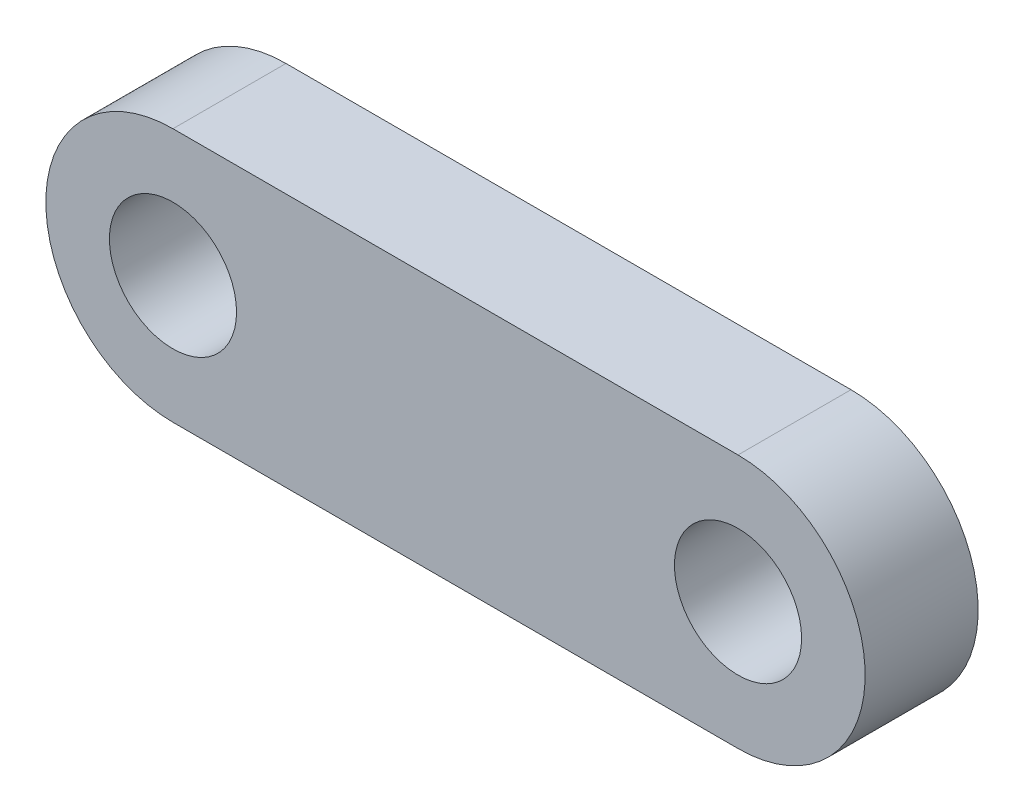
ISO-10303-21;
HEADER;
FILE_DESCRIPTION(('STEP AP214'),'2;1');
FILE_NAME('part.step','',(''),(''),'','','');
FILE_SCHEMA(('AUTOMOTIVE_DESIGN { 1 0 10303 214 1 1 1 1 }'));
ENDSEC;
DATA;
#1=APPLICATION_CONTEXT('core data for automotive mechanical design processes');
#2=APPLICATION_PROTOCOL_DEFINITION('international standard','automotive_design',2000,#1);
#3=PRODUCT_CONTEXT('',#1,'mechanical');
#4=PRODUCT('Part','Part','',(#3));
#5=PRODUCT_RELATED_PRODUCT_CATEGORY('part','',(#4));
#6=PRODUCT_DEFINITION_FORMATION('','',#4);
#7=PRODUCT_DEFINITION_CONTEXT('part definition',#1,'design');
#8=PRODUCT_DEFINITION('design','',#6,#7);
#9=PRODUCT_DEFINITION_SHAPE('','',#8);
#10=(LENGTH_UNIT() NAMED_UNIT(*) SI_UNIT(.MILLI.,.METRE.));
#11=(NAMED_UNIT(*) PLANE_ANGLE_UNIT() SI_UNIT($,.RADIAN.));
#12=(NAMED_UNIT(*) SI_UNIT($,.STERADIAN.) SOLID_ANGLE_UNIT());
#13=UNCERTAINTY_MEASURE_WITH_UNIT(LENGTH_MEASURE(1.E-05),#10,'distance_accuracy_value','');
#14=(GEOMETRIC_REPRESENTATION_CONTEXT(3) GLOBAL_UNCERTAINTY_ASSIGNED_CONTEXT((#13)) GLOBAL_UNIT_ASSIGNED_CONTEXT((#10,
#11,#12)) REPRESENTATION_CONTEXT('',''));
#15=CARTESIAN_POINT('',(0.,0.,0.));
#16=DIRECTION('',(0.,0.,1.));
#17=DIRECTION('',(1.,0.,0.));
#18=AXIS2_PLACEMENT_3D('',#15,#16,#17);
#19=CARTESIAN_POINT('',(-10.,0.,4.));
#20=DIRECTION('',(0.,0.,-1.));
#21=DIRECTION('',(-1.,0.,0.));
#22=AXIS2_PLACEMENT_3D('',#19,#20,#21);
#23=CYLINDRICAL_SURFACE('',#22,4.5);
#24=CARTESIAN_POINT('',(-10.,0.,0.));
#25=DIRECTION('',(0.,0.,1.));
#26=DIRECTION('',(1.,0.,0.));
#27=AXIS2_PLACEMENT_3D('',#24,#25,#26);
#28=CIRCLE('',#27,4.5);
#29=CARTESIAN_POINT('',(-10.,4.5,0.));
#30=VERTEX_POINT('',#29);
#31=CARTESIAN_POINT('',(-10.,-4.5,0.));
#32=VERTEX_POINT('',#31);
#33=EDGE_CURVE('E118',#30,#32,#28,.T.);
#34=ORIENTED_EDGE('',*,*,#33,.T.);
#35=DIRECTION('',(0.,0.,-1.));
#36=VECTOR('',#35,1.);
#37=CARTESIAN_POINT('',(-10.,-4.5,4.));
#38=LINE('',#37,#36);
#39=CARTESIAN_POINT('',(-10.,-4.5,4.));
#40=VERTEX_POINT('',#39);
#41=EDGE_CURVE('E11',#40,#32,#38,.T.);
#42=ORIENTED_EDGE('',*,*,#41,.F.);
#43=CARTESIAN_POINT('',(-10.,0.,4.));
#44=DIRECTION('',(0.,0.,1.));
#45=DIRECTION('',(1.,0.,0.));
#46=AXIS2_PLACEMENT_3D('',#43,#44,#45);
#47=CIRCLE('',#46,4.5);
#48=CARTESIAN_POINT('',(-10.,4.5,4.));
#49=VERTEX_POINT('',#48);
#50=EDGE_CURVE('E87',#49,#40,#47,.T.);
#51=ORIENTED_EDGE('',*,*,#50,.F.);
#52=DIRECTION('',(0.,0.,-1.));
#53=VECTOR('',#52,1.);
#54=CARTESIAN_POINT('',(-10.,4.5,4.));
#55=LINE('',#54,#53);
#56=EDGE_CURVE('E62',#49,#30,#55,.T.);
#57=ORIENTED_EDGE('',*,*,#56,.T.);
#58=EDGE_LOOP('',(#34,#42,#51,#57));
#59=FACE_BOUND('',#58,.T.);
#60=ADVANCED_FACE('F45',(#59),#23,.T.);
#61=CARTESIAN_POINT('',(0.,-4.5,4.));
#62=DIRECTION('',(0.,-1.,0.));
#63=DIRECTION('',(1.,0.,0.));
#64=AXIS2_PLACEMENT_3D('',#61,#62,#63);
#65=PLANE('',#64);
#66=DIRECTION('',(-1.,0.,0.));
#67=VECTOR('',#66,1.);
#68=CARTESIAN_POINT('',(0.,-4.5,0.));
#69=LINE('',#68,#67);
#70=CARTESIAN_POINT('',(10.,-4.5,0.));
#71=VERTEX_POINT('',#70);
#72=EDGE_CURVE('E97',#71,#32,#69,.T.);
#73=ORIENTED_EDGE('',*,*,#72,.F.);
#74=DIRECTION('',(0.,0.,-1.));
#75=VECTOR('',#74,1.);
#76=CARTESIAN_POINT('',(10.,-4.5,4.));
#77=LINE('',#76,#75);
#78=CARTESIAN_POINT('',(10.,-4.5,4.));
#79=VERTEX_POINT('',#78);
#80=EDGE_CURVE('E54',#79,#71,#77,.T.);
#81=ORIENTED_EDGE('',*,*,#80,.F.);
#82=DIRECTION('',(-1.,0.,0.));
#83=VECTOR('',#82,1.);
#84=CARTESIAN_POINT('',(0.,-4.5,4.));
#85=LINE('',#84,#83);
#86=EDGE_CURVE('E95',#79,#40,#85,.T.);
#87=ORIENTED_EDGE('',*,*,#86,.T.);
#88=ORIENTED_EDGE('',*,*,#41,.T.);
#89=EDGE_LOOP('',(#73,#81,#87,#88));
#90=FACE_BOUND('',#89,.T.);
#91=ADVANCED_FACE('F94',(#90),#65,.T.);
#92=CARTESIAN_POINT('',(10.,0.,4.));
#93=DIRECTION('',(0.,0.,-1.));
#94=DIRECTION('',(-1.,0.,0.));
#95=AXIS2_PLACEMENT_3D('',#92,#93,#94);
#96=CYLINDRICAL_SURFACE('',#95,4.5);
#97=CARTESIAN_POINT('',(10.,0.,0.));
#98=DIRECTION('',(0.,0.,1.));
#99=DIRECTION('',(1.,0.,0.));
#100=AXIS2_PLACEMENT_3D('',#97,#98,#99);
#101=CIRCLE('',#100,4.5);
#102=CARTESIAN_POINT('',(10.,4.5,0.));
#103=VERTEX_POINT('',#102);
#104=EDGE_CURVE('E121',#71,#103,#101,.T.);
#105=ORIENTED_EDGE('',*,*,#104,.T.);
#106=DIRECTION('',(0.,0.,-1.));
#107=VECTOR('',#106,1.);
#108=CARTESIAN_POINT('',(10.,4.5,4.));
#109=LINE('',#108,#107);
#110=CARTESIAN_POINT('',(10.,4.5,4.));
#111=VERTEX_POINT('',#110);
#112=EDGE_CURVE('E76',#111,#103,#109,.T.);
#113=ORIENTED_EDGE('',*,*,#112,.F.);
#114=CARTESIAN_POINT('',(10.,0.,4.));
#115=DIRECTION('',(0.,0.,1.));
#116=DIRECTION('',(1.,0.,0.));
#117=AXIS2_PLACEMENT_3D('',#114,#115,#116);
#118=CIRCLE('',#117,4.5);
#119=EDGE_CURVE('E100',#79,#111,#118,.T.);
#120=ORIENTED_EDGE('',*,*,#119,.F.);
#121=ORIENTED_EDGE('',*,*,#80,.T.);
#122=EDGE_LOOP('',(#105,#113,#120,#121));
#123=FACE_BOUND('',#122,.T.);
#124=ADVANCED_FACE('F101',(#123),#96,.T.);
#125=CARTESIAN_POINT('',(0.,4.5,4.));
#126=DIRECTION('',(0.,1.,0.));
#127=DIRECTION('',(-1.,0.,0.));
#128=AXIS2_PLACEMENT_3D('',#125,#126,#127);
#129=PLANE('',#128);
#130=DIRECTION('',(1.,0.,0.));
#131=VECTOR('',#130,1.);
#132=CARTESIAN_POINT('',(0.,4.5,0.));
#133=LINE('',#132,#131);
#134=EDGE_CURVE('E123',#30,#103,#133,.T.);
#135=ORIENTED_EDGE('',*,*,#134,.F.);
#136=ORIENTED_EDGE('',*,*,#56,.F.);
#137=DIRECTION('',(1.,0.,0.));
#138=VECTOR('',#137,1.);
#139=CARTESIAN_POINT('',(0.,4.5,4.));
#140=LINE('',#139,#138);
#141=EDGE_CURVE('E102',#49,#111,#140,.T.);
#142=ORIENTED_EDGE('',*,*,#141,.T.);
#143=ORIENTED_EDGE('',*,*,#112,.T.);
#144=EDGE_LOOP('',(#135,#136,#142,#143));
#145=FACE_BOUND('',#144,.T.);
#146=ADVANCED_FACE('F157',(#145),#129,.T.);
#147=CARTESIAN_POINT('',(-10.,0.,4.));
#148=DIRECTION('',(0.,0.,-1.));
#149=DIRECTION('',(-1.,0.,0.));
#150=AXIS2_PLACEMENT_3D('',#147,#148,#149);
#151=CYLINDRICAL_SURFACE('',#150,2.25);
#152=CARTESIAN_POINT('',(-10.,0.,4.));
#153=DIRECTION('',(0.,0.,1.));
#154=DIRECTION('',(1.,0.,0.));
#155=AXIS2_PLACEMENT_3D('',#152,#153,#154);
#156=CIRCLE('',#155,2.25);
#157=CARTESIAN_POINT('',(-7.75,0.,4.));
#158=VERTEX_POINT('',#157);
#159=EDGE_CURVE('E107',#158,#158,#156,.T.);
#160=ORIENTED_EDGE('',*,*,#159,.T.);
#161=EDGE_LOOP('',(#160));
#162=FACE_BOUND('',#161,.T.);
#163=CARTESIAN_POINT('',(-10.,0.,0.));
#164=DIRECTION('',(0.,0.,1.));
#165=DIRECTION('',(1.,0.,0.));
#166=AXIS2_PLACEMENT_3D('',#163,#164,#165);
#167=CIRCLE('',#166,2.25);
#168=CARTESIAN_POINT('',(-7.75,0.,0.));
#169=VERTEX_POINT('',#168);
#170=EDGE_CURVE('E115',#169,#169,#167,.T.);
#171=ORIENTED_EDGE('',*,*,#170,.F.);
#172=EDGE_LOOP('',(#171));
#173=FACE_BOUND('',#172,.T.);
#174=ADVANCED_FACE('F47',(#162,#173),#151,.F.);
#175=CARTESIAN_POINT('',(10.,0.,4.));
#176=DIRECTION('',(0.,0.,-1.));
#177=DIRECTION('',(-1.,0.,0.));
#178=AXIS2_PLACEMENT_3D('',#175,#176,#177);
#179=CYLINDRICAL_SURFACE('',#178,2.25);
#180=CARTESIAN_POINT('',(10.,0.,4.));
#181=DIRECTION('',(0.,0.,1.));
#182=DIRECTION('',(1.,0.,0.));
#183=AXIS2_PLACEMENT_3D('',#180,#181,#182);
#184=CIRCLE('',#183,2.25);
#185=CARTESIAN_POINT('',(12.25,0.,4.));
#186=VERTEX_POINT('',#185);
#187=EDGE_CURVE('E112',#186,#186,#184,.T.);
#188=ORIENTED_EDGE('',*,*,#187,.T.);
#189=EDGE_LOOP('',(#188));
#190=FACE_BOUND('',#189,.T.);
#191=CARTESIAN_POINT('',(10.,0.,0.));
#192=DIRECTION('',(0.,0.,1.));
#193=DIRECTION('',(1.,0.,0.));
#194=AXIS2_PLACEMENT_3D('',#191,#192,#193);
#195=CIRCLE('',#194,2.25);
#196=CARTESIAN_POINT('',(12.25,0.,0.));
#197=VERTEX_POINT('',#196);
#198=EDGE_CURVE('E126',#197,#197,#195,.T.);
#199=ORIENTED_EDGE('',*,*,#198,.F.);
#200=EDGE_LOOP('',(#199));
#201=FACE_BOUND('',#200,.T.);
#202=ADVANCED_FACE('F139',(#190,#201),#179,.F.);
#203=CARTESIAN_POINT('',(0.,0.,4.));
#204=DIRECTION('',(0.,0.,1.));
#205=DIRECTION('',(1.,0.,0.));
#206=AXIS2_PLACEMENT_3D('',#203,#204,#205);
#207=PLANE('',#206);
#208=ORIENTED_EDGE('',*,*,#159,.F.);
#209=EDGE_LOOP('',(#208));
#210=FACE_BOUND('',#209,.T.);
#211=ORIENTED_EDGE('',*,*,#50,.T.);
#212=ORIENTED_EDGE('',*,*,#86,.F.);
#213=ORIENTED_EDGE('',*,*,#119,.T.);
#214=ORIENTED_EDGE('',*,*,#141,.F.);
#215=EDGE_LOOP('',(#211,#212,#213,#214));
#216=FACE_BOUND('',#215,.T.);
#217=ORIENTED_EDGE('',*,*,#187,.F.);
#218=EDGE_LOOP('',(#217));
#219=FACE_BOUND('',#218,.T.);
#220=ADVANCED_FACE('F104',(#210,#216,#219),#207,.T.);
#221=CARTESIAN_POINT('',(0.,0.,0.));
#222=DIRECTION('',(0.,0.,1.));
#223=DIRECTION('',(1.,0.,0.));
#224=AXIS2_PLACEMENT_3D('',#221,#222,#223);
#225=PLANE('',#224);
#226=ORIENTED_EDGE('',*,*,#170,.T.);
#227=EDGE_LOOP('',(#226));
#228=FACE_BOUND('',#227,.T.);
#229=ORIENTED_EDGE('',*,*,#33,.F.);
#230=ORIENTED_EDGE('',*,*,#134,.T.);
#231=ORIENTED_EDGE('',*,*,#104,.F.);
#232=ORIENTED_EDGE('',*,*,#72,.T.);
#233=EDGE_LOOP('',(#229,#230,#231,#232));
#234=FACE_BOUND('',#233,.T.);
#235=ORIENTED_EDGE('',*,*,#198,.T.);
#236=EDGE_LOOP('',(#235));
#237=FACE_BOUND('',#236,.T.);
#238=ADVANCED_FACE('F138',(#228,#234,#237),#225,.F.);
#239=CLOSED_SHELL('',(#60,#91,#124,#146,#174,#202,#220,#238));
#240=MANIFOLD_SOLID_BREP('B2',#239);
#241=ADVANCED_BREP_SHAPE_REPRESENTATION('',(#18,#240),#14);
#242=SHAPE_DEFINITION_REPRESENTATION(#9,#241);
ENDSEC;
END-ISO-10303-21;
